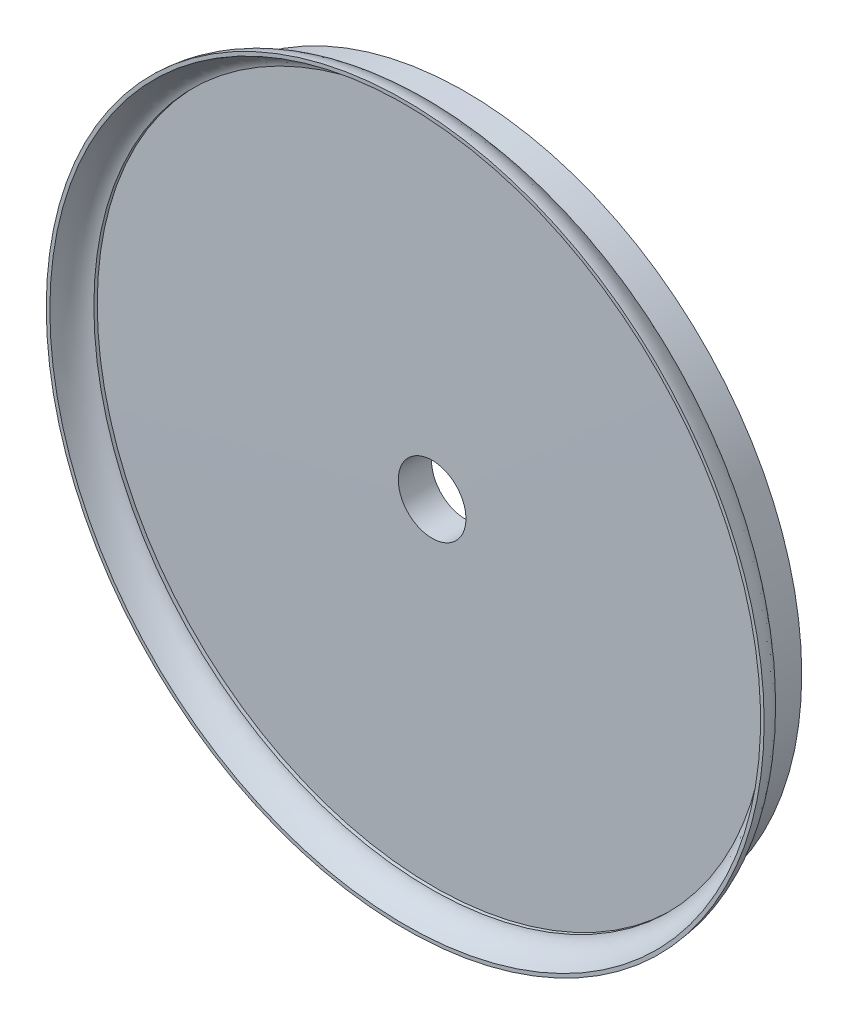
ISO-10303-21;
HEADER;
FILE_DESCRIPTION(('STEP AP214'),'2;1');
FILE_NAME('part.step','',(''),(''),'','','');
FILE_SCHEMA(('AUTOMOTIVE_DESIGN { 1 0 10303 214 1 1 1 1 }'));
ENDSEC;
DATA;
#1=APPLICATION_CONTEXT('core data for automotive mechanical design processes');
#2=APPLICATION_PROTOCOL_DEFINITION('international standard','automotive_design',2000,#1);
#3=PRODUCT_CONTEXT('',#1,'mechanical');
#4=PRODUCT('Part','Part','',(#3));
#5=PRODUCT_RELATED_PRODUCT_CATEGORY('part','',(#4));
#6=PRODUCT_DEFINITION_FORMATION('','',#4);
#7=PRODUCT_DEFINITION_CONTEXT('part definition',#1,'design');
#8=PRODUCT_DEFINITION('design','',#6,#7);
#9=PRODUCT_DEFINITION_SHAPE('','',#8);
#10=(LENGTH_UNIT() NAMED_UNIT(*) SI_UNIT(.MILLI.,.METRE.));
#11=(NAMED_UNIT(*) PLANE_ANGLE_UNIT() SI_UNIT($,.RADIAN.));
#12=(NAMED_UNIT(*) SI_UNIT($,.STERADIAN.) SOLID_ANGLE_UNIT());
#13=UNCERTAINTY_MEASURE_WITH_UNIT(LENGTH_MEASURE(1.E-05),#10,'distance_accuracy_value','');
#14=(GEOMETRIC_REPRESENTATION_CONTEXT(3) GLOBAL_UNCERTAINTY_ASSIGNED_CONTEXT((#13)) GLOBAL_UNIT_ASSIGNED_CONTEXT((#10,
#11,#12)) REPRESENTATION_CONTEXT('',''));
#15=CARTESIAN_POINT('',(0.,0.,0.));
#16=DIRECTION('',(0.,0.,1.));
#17=DIRECTION('',(1.,0.,0.));
#18=AXIS2_PLACEMENT_3D('',#15,#16,#17);
#19=CARTESIAN_POINT('',(0.,0.,4.));
#20=DIRECTION('',(0.,0.,-1.));
#21=DIRECTION('',(-1.,0.,0.));
#22=AXIS2_PLACEMENT_3D('',#19,#20,#21);
#23=CYLINDRICAL_SURFACE('',#22,44.75);
#24=CARTESIAN_POINT('',(0.,0.,4.));
#25=DIRECTION('',(0.,0.,1.));
#26=DIRECTION('',(1.,0.,0.));
#27=AXIS2_PLACEMENT_3D('',#24,#25,#26);
#28=CIRCLE('',#27,44.75);
#29=CARTESIAN_POINT('',(44.75,0.,4.));
#30=VERTEX_POINT('',#29);
#31=EDGE_CURVE('E47',#30,#30,#28,.T.);
#32=ORIENTED_EDGE('',*,*,#31,.F.);
#33=EDGE_LOOP('',(#32));
#34=FACE_BOUND('',#33,.T.);
#35=CARTESIAN_POINT('',(0.,0.,0.));
#36=DIRECTION('',(0.,0.,1.));
#37=DIRECTION('',(1.,0.,0.));
#38=AXIS2_PLACEMENT_3D('',#35,#36,#37);
#39=CIRCLE('',#38,44.75);
#40=CARTESIAN_POINT('',(44.75,0.,0.));
#41=VERTEX_POINT('',#40);
#42=EDGE_CURVE('E10',#41,#41,#39,.T.);
#43=ORIENTED_EDGE('',*,*,#42,.T.);
#44=EDGE_LOOP('',(#43));
#45=FACE_BOUND('',#44,.T.);
#46=ADVANCED_FACE('F36',(#34,#45),#23,.T.);
#47=CARTESIAN_POINT('',(0.,0.,0.));
#48=DIRECTION('',(0.,0.,1.));
#49=DIRECTION('',(1.,0.,0.));
#50=AXIS2_PLACEMENT_3D('',#47,#48,#49);
#51=PLANE('',#50);
#52=CARTESIAN_POINT('',(0.,0.,0.));
#53=DIRECTION('',(0.,0.,-1.));
#54=DIRECTION('',(-1.,0.,0.));
#55=AXIS2_PLACEMENT_3D('',#52,#53,#54);
#56=CIRCLE('',#55,4.5);
#57=CARTESIAN_POINT('',(-4.5,0.,0.));
#58=VERTEX_POINT('',#57);
#59=EDGE_CURVE('E82',#58,#58,#56,.T.);
#60=ORIENTED_EDGE('',*,*,#59,.F.);
#61=EDGE_LOOP('',(#60));
#62=FACE_BOUND('',#61,.T.);
#63=ORIENTED_EDGE('',*,*,#42,.F.);
#64=EDGE_LOOP('',(#63));
#65=FACE_BOUND('',#64,.T.);
#66=ADVANCED_FACE('F67',(#62,#65),#51,.F.);
#67=CARTESIAN_POINT('',(0.,47.75,8.));
#68=CARTESIAN_POINT('',(0.,47.7003468196795,5.5165510601066));
#69=CARTESIAN_POINT('',(0.,44.75,4.));
#70=B_SPLINE_CURVE_WITH_KNOTS('',2,(#67,#68,#69),.UNSPECIFIED.,.F.,.F.,(3,3),(0.,
0.966897879786251),.UNSPECIFIED.);
#71=CARTESIAN_POINT('',(0.,0.,14.6180901420264));
#72=DIRECTION('',(0.,0.,1.));
#73=AXIS1_PLACEMENT('',#71,#72);
#74=SURFACE_OF_REVOLUTION('',#70,#73);
#75=ORIENTED_EDGE('',*,*,#31,.T.);
#76=EDGE_LOOP('',(#75));
#77=FACE_BOUND('',#76,.T.);
#78=CARTESIAN_POINT('',(0.,0.,8.));
#79=DIRECTION('',(0.,0.,1.));
#80=DIRECTION('',(1.,0.,0.));
#81=AXIS2_PLACEMENT_3D('',#78,#79,#80);
#82=CIRCLE('',#81,47.75);
#83=CARTESIAN_POINT('',(47.75,0.,8.));
#84=VERTEX_POINT('',#83);
#85=EDGE_CURVE('E43',#84,#84,#82,.T.);
#86=ORIENTED_EDGE('',*,*,#85,.F.);
#87=EDGE_LOOP('',(#86));
#88=FACE_BOUND('',#87,.T.);
#89=ADVANCED_FACE('F62',(#77,#88),#74,.F.);
#90=CARTESIAN_POINT('',(0.,0.,8.));
#91=DIRECTION('',(0.,0.,1.));
#92=DIRECTION('',(1.,0.,0.));
#93=AXIS2_PLACEMENT_3D('',#90,#91,#92);
#94=PLANE('',#93);
#95=CARTESIAN_POINT('',(0.,0.,8.00000000000001));
#96=DIRECTION('',(0.,0.,-1.));
#97=DIRECTION('',(-1.,0.,0.));
#98=AXIS2_PLACEMENT_3D('',#95,#96,#97);
#99=CIRCLE('',#98,47.2728514017731);
#100=CARTESIAN_POINT('',(-47.2728514017731,0.,8.00000000000001));
#101=VERTEX_POINT('',#100);
#102=EDGE_CURVE('E86',#101,#101,#99,.T.);
#103=ORIENTED_EDGE('',*,*,#102,.T.);
#104=EDGE_LOOP('',(#103));
#105=FACE_BOUND('',#104,.T.);
#106=ORIENTED_EDGE('',*,*,#85,.T.);
#107=EDGE_LOOP('',(#106));
#108=FACE_BOUND('',#107,.T.);
#109=ADVANCED_FACE('F66',(#105,#108),#94,.T.);
#110=CARTESIAN_POINT('',(0.,0.,4.44273815177156));
#111=DIRECTION('',(0.,0.,-1.));
#112=DIRECTION('',(-1.,0.,0.));
#113=AXIS2_PLACEMENT_3D('',#110,#111,#112);
#114=CONICAL_SURFACE('',#113,0.,1.56576563170434);
#115=CARTESIAN_POINT('',(0.,0.,4.4200998328877));
#116=DIRECTION('',(0.,0.,-1.));
#117=DIRECTION('',(-1.,0.,0.));
#118=AXIS2_PLACEMENT_3D('',#115,#116,#117);
#119=CIRCLE('',#118,4.5);
#120=CARTESIAN_POINT('',(-4.5,0.,4.4200998328877));
#121=VERTEX_POINT('',#120);
#122=EDGE_CURVE('E39',#121,#121,#119,.T.);
#123=ORIENTED_EDGE('',*,*,#122,.T.);
#124=EDGE_LOOP('',(#123));
#125=FACE_BOUND('',#124,.T.);
#126=CARTESIAN_POINT('',(0.,0.,4.21761264731543));
#127=DIRECTION('',(0.,0.,-1.));
#128=DIRECTION('',(-1.,0.,0.));
#129=AXIS2_PLACEMENT_3D('',#126,#127,#128);
#130=CIRCLE('',#129,44.75);
#131=CARTESIAN_POINT('',(-44.75,0.,4.21761264731543));
#132=VERTEX_POINT('',#131);
#133=EDGE_CURVE('E52',#132,#132,#130,.T.);
#134=ORIENTED_EDGE('',*,*,#133,.F.);
#135=EDGE_LOOP('',(#134));
#136=FACE_BOUND('',#135,.T.);
#137=ADVANCED_FACE('F69',(#125,#136),#114,.T.);
#138=CARTESIAN_POINT('',(0.,0.,4.44273815177156));
#139=DIRECTION('',(0.,0.,-1.));
#140=DIRECTION('',(-1.,0.,0.));
#141=AXIS2_PLACEMENT_3D('',#138,#139,#140);
#142=CYLINDRICAL_SURFACE('',#141,44.75);
#143=CARTESIAN_POINT('',(0.,0.,4.66786365622769));
#144=DIRECTION('',(0.,0.,-1.));
#145=DIRECTION('',(-1.,0.,0.));
#146=AXIS2_PLACEMENT_3D('',#143,#144,#145);
#147=CIRCLE('',#146,44.75);
#148=CARTESIAN_POINT('',(-44.75,0.,4.66786365622769));
#149=VERTEX_POINT('',#148);
#150=EDGE_CURVE('E111',#149,#149,#147,.T.);
#151=ORIENTED_EDGE('',*,*,#150,.F.);
#152=EDGE_LOOP('',(#151));
#153=FACE_BOUND('',#152,.T.);
#154=ORIENTED_EDGE('',*,*,#133,.T.);
#155=EDGE_LOOP('',(#154));
#156=FACE_BOUND('',#155,.T.);
#157=ADVANCED_FACE('F100',(#153,#156),#142,.F.);
#158=CARTESIAN_POINT('',(0.,44.75,4.66786365622769));
#159=CARTESIAN_POINT('',(0.,46.3586580096755,5.02066925728116));
#160=CARTESIAN_POINT('',(0.,47.2728514017731,8.00000000000001));
#161=B_SPLINE_CURVE_WITH_KNOTS('',2,(#158,#159,#160),.UNSPECIFIED.,.F.,.F.,(3,3),(0.,
0.527215109841536),.UNSPECIFIED.);
#162=CARTESIAN_POINT('',(0.,0.,4.44273815177156));
#163=DIRECTION('',(0.,0.,-1.));
#164=AXIS1_PLACEMENT('',#162,#163);
#165=SURFACE_OF_REVOLUTION('',#161,#164);
#166=ORIENTED_EDGE('',*,*,#102,.F.);
#167=EDGE_LOOP('',(#166));
#168=FACE_BOUND('',#167,.T.);
#169=ORIENTED_EDGE('',*,*,#150,.T.);
#170=EDGE_LOOP('',(#169));
#171=FACE_BOUND('',#170,.T.);
#172=ADVANCED_FACE('F96',(#168,#171),#165,.T.);
#173=CARTESIAN_POINT('',(0.,0.,10.));
#174=DIRECTION('',(0.,0.,-1.));
#175=DIRECTION('',(-1.,0.,0.));
#176=AXIS2_PLACEMENT_3D('',#173,#174,#175);
#177=CYLINDRICAL_SURFACE('',#176,4.5);
#178=ORIENTED_EDGE('',*,*,#59,.T.);
#179=EDGE_LOOP('',(#178));
#180=FACE_BOUND('',#179,.T.);
#181=ORIENTED_EDGE('',*,*,#122,.F.);
#182=EDGE_LOOP('',(#181));
#183=FACE_BOUND('',#182,.T.);
#184=ADVANCED_FACE('F99',(#180,#183),#177,.F.);
#185=CLOSED_SHELL('',(#46,#66,#89,#109,#137,#157,#172,#184));
#186=MANIFOLD_SOLID_BREP('B2',#185);
#187=ADVANCED_BREP_SHAPE_REPRESENTATION('',(#18,#186),#14);
#188=SHAPE_DEFINITION_REPRESENTATION(#9,#187);
ENDSEC;
END-ISO-10303-21;
